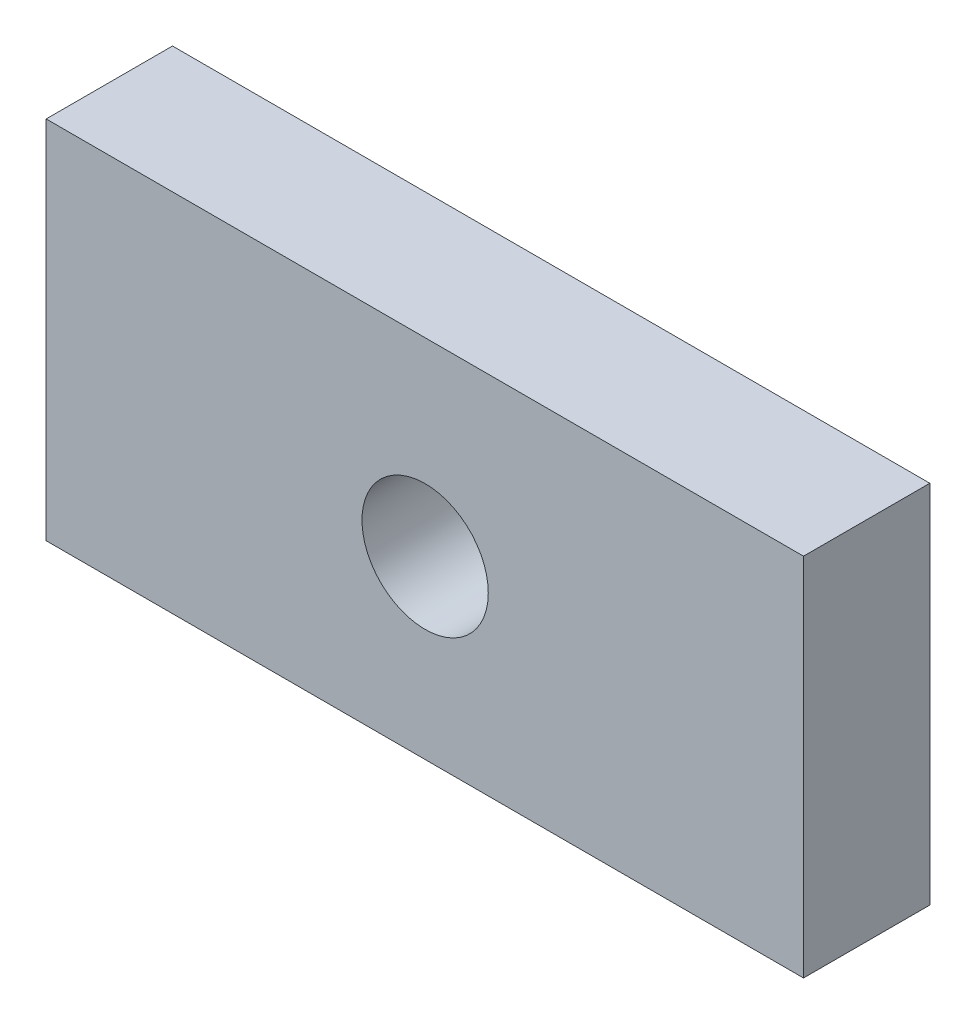
ISO-10303-21;
HEADER;
FILE_DESCRIPTION(('STEP AP214'),'2;1');
FILE_NAME('part.step','',(''),(''),'','','');
FILE_SCHEMA(('AUTOMOTIVE_DESIGN { 1 0 10303 214 1 1 1 1 }'));
ENDSEC;
DATA;
#1=APPLICATION_CONTEXT('core data for automotive mechanical design processes');
#2=APPLICATION_PROTOCOL_DEFINITION('international standard','automotive_design',2000,#1);
#3=PRODUCT_CONTEXT('',#1,'mechanical');
#4=PRODUCT('Part','Part','',(#3));
#5=PRODUCT_RELATED_PRODUCT_CATEGORY('part','',(#4));
#6=PRODUCT_DEFINITION_FORMATION('','',#4);
#7=PRODUCT_DEFINITION_CONTEXT('part definition',#1,'design');
#8=PRODUCT_DEFINITION('design','',#6,#7);
#9=PRODUCT_DEFINITION_SHAPE('','',#8);
#10=(LENGTH_UNIT() NAMED_UNIT(*) SI_UNIT(.MILLI.,.METRE.));
#11=(NAMED_UNIT(*) PLANE_ANGLE_UNIT() SI_UNIT($,.RADIAN.));
#12=(NAMED_UNIT(*) SI_UNIT($,.STERADIAN.) SOLID_ANGLE_UNIT());
#13=UNCERTAINTY_MEASURE_WITH_UNIT(LENGTH_MEASURE(1.E-05),#10,'distance_accuracy_value','');
#14=(GEOMETRIC_REPRESENTATION_CONTEXT(3) GLOBAL_UNCERTAINTY_ASSIGNED_CONTEXT((#13)) GLOBAL_UNIT_ASSIGNED_CONTEXT((#10,
#11,#12)) REPRESENTATION_CONTEXT('',''));
#15=CARTESIAN_POINT('',(0.,0.,0.));
#16=DIRECTION('',(0.,0.,1.));
#17=DIRECTION('',(1.,0.,0.));
#18=AXIS2_PLACEMENT_3D('',#15,#16,#17);
#19=CARTESIAN_POINT('',(0.,0.,12.7));
#20=DIRECTION('',(1.,0.,0.));
#21=DIRECTION('',(0.,0.,-1.));
#22=AXIS2_PLACEMENT_3D('',#19,#20,#21);
#23=PLANE('',#22);
#24=DIRECTION('',(0.,-1.,0.));
#25=VECTOR('',#24,1.);
#26=CARTESIAN_POINT('',(0.,0.,0.));
#27=LINE('',#26,#25);
#28=CARTESIAN_POINT('',(0.,36.7287288622178,0.));
#29=VERTEX_POINT('',#28);
#30=CARTESIAN_POINT('',(0.,0.,0.));
#31=VERTEX_POINT('',#30);
#32=EDGE_CURVE('E107',#29,#31,#27,.T.);
#33=ORIENTED_EDGE('',*,*,#32,.T.);
#34=DIRECTION('',(0.,0.,-1.));
#35=VECTOR('',#34,1.);
#36=CARTESIAN_POINT('',(0.,0.,12.7));
#37=LINE('',#36,#35);
#38=CARTESIAN_POINT('',(0.,0.,12.7));
#39=VERTEX_POINT('',#38);
#40=EDGE_CURVE('E11',#39,#31,#37,.T.);
#41=ORIENTED_EDGE('',*,*,#40,.F.);
#42=DIRECTION('',(0.,-1.,0.));
#43=VECTOR('',#42,1.);
#44=CARTESIAN_POINT('',(0.,0.,12.7));
#45=LINE('',#44,#43);
#46=CARTESIAN_POINT('',(0.,36.7287288622178,12.7));
#47=VERTEX_POINT('',#46);
#48=EDGE_CURVE('E91',#47,#39,#45,.T.);
#49=ORIENTED_EDGE('',*,*,#48,.F.);
#50=DIRECTION('',(0.,0.,-1.));
#51=VECTOR('',#50,1.);
#52=CARTESIAN_POINT('',(0.,36.7287288622178,12.7));
#53=LINE('',#52,#51);
#54=EDGE_CURVE('E103',#47,#29,#53,.T.);
#55=ORIENTED_EDGE('',*,*,#54,.T.);
#56=EDGE_LOOP('',(#33,#41,#49,#55));
#57=FACE_BOUND('',#56,.T.);
#58=ADVANCED_FACE('F39',(#57),#23,.F.);
#59=CARTESIAN_POINT('',(0.,0.,12.7));
#60=DIRECTION('',(0.,1.,0.));
#61=DIRECTION('',(0.,0.,1.));
#62=AXIS2_PLACEMENT_3D('',#59,#60,#61);
#63=PLANE('',#62);
#64=DIRECTION('',(1.,0.,0.));
#65=VECTOR('',#64,1.);
#66=CARTESIAN_POINT('',(0.,0.,0.));
#67=LINE('',#66,#65);
#68=CARTESIAN_POINT('',(76.1425867274176,0.,0.));
#69=VERTEX_POINT('',#68);
#70=EDGE_CURVE('E96',#31,#69,#67,.T.);
#71=ORIENTED_EDGE('',*,*,#70,.T.);
#72=DIRECTION('',(0.,0.,-1.));
#73=VECTOR('',#72,1.);
#74=CARTESIAN_POINT('',(76.1425867274176,0.,12.7));
#75=LINE('',#74,#73);
#76=CARTESIAN_POINT('',(76.1425867274176,0.,12.7));
#77=VERTEX_POINT('',#76);
#78=EDGE_CURVE('E48',#77,#69,#75,.T.);
#79=ORIENTED_EDGE('',*,*,#78,.F.);
#80=DIRECTION('',(1.,0.,0.));
#81=VECTOR('',#80,1.);
#82=CARTESIAN_POINT('',(0.,0.,12.7));
#83=LINE('',#82,#81);
#84=EDGE_CURVE('E86',#39,#77,#83,.T.);
#85=ORIENTED_EDGE('',*,*,#84,.F.);
#86=ORIENTED_EDGE('',*,*,#40,.T.);
#87=EDGE_LOOP('',(#71,#79,#85,#86));
#88=FACE_BOUND('',#87,.T.);
#89=ADVANCED_FACE('F95',(#88),#63,.F.);
#90=CARTESIAN_POINT('',(76.1425867274176,0.,12.7));
#91=DIRECTION('',(-1.,0.,0.));
#92=DIRECTION('',(0.,0.,1.));
#93=AXIS2_PLACEMENT_3D('',#90,#91,#92);
#94=PLANE('',#93);
#95=DIRECTION('',(0.,1.,0.));
#96=VECTOR('',#95,1.);
#97=CARTESIAN_POINT('',(76.1425867274176,0.,0.));
#98=LINE('',#97,#96);
#99=CARTESIAN_POINT('',(76.1425867274176,36.7287288622178,0.));
#100=VERTEX_POINT('',#99);
#101=EDGE_CURVE('E73',#69,#100,#98,.T.);
#102=ORIENTED_EDGE('',*,*,#101,.T.);
#103=DIRECTION('',(0.,0.,-1.));
#104=VECTOR('',#103,1.);
#105=CARTESIAN_POINT('',(76.1425867274176,36.7287288622178,12.7));
#106=LINE('',#105,#104);
#107=CARTESIAN_POINT('',(76.1425867274176,36.7287288622178,12.7));
#108=VERTEX_POINT('',#107);
#109=EDGE_CURVE('E98',#108,#100,#106,.T.);
#110=ORIENTED_EDGE('',*,*,#109,.F.);
#111=DIRECTION('',(0.,1.,0.));
#112=VECTOR('',#111,1.);
#113=CARTESIAN_POINT('',(76.1425867274176,0.,12.7));
#114=LINE('',#113,#112);
#115=EDGE_CURVE('E89',#77,#108,#114,.T.);
#116=ORIENTED_EDGE('',*,*,#115,.F.);
#117=ORIENTED_EDGE('',*,*,#78,.T.);
#118=EDGE_LOOP('',(#102,#110,#116,#117));
#119=FACE_BOUND('',#118,.T.);
#120=ADVANCED_FACE('F99',(#119),#94,.F.);
#121=CARTESIAN_POINT('',(0.,36.7287288622178,12.7));
#122=DIRECTION('',(0.,-1.,0.));
#123=DIRECTION('',(0.,0.,-1.));
#124=AXIS2_PLACEMENT_3D('',#121,#122,#123);
#125=PLANE('',#124);
#126=DIRECTION('',(-1.,0.,0.));
#127=VECTOR('',#126,1.);
#128=CARTESIAN_POINT('',(0.,36.7287288622178,0.));
#129=LINE('',#128,#127);
#130=EDGE_CURVE('E79',#100,#29,#129,.T.);
#131=ORIENTED_EDGE('',*,*,#130,.T.);
#132=ORIENTED_EDGE('',*,*,#54,.F.);
#133=DIRECTION('',(-1.,0.,0.));
#134=VECTOR('',#133,1.);
#135=CARTESIAN_POINT('',(0.,36.7287288622178,12.7));
#136=LINE('',#135,#134);
#137=EDGE_CURVE('E56',#108,#47,#136,.T.);
#138=ORIENTED_EDGE('',*,*,#137,.F.);
#139=ORIENTED_EDGE('',*,*,#109,.T.);
#140=EDGE_LOOP('',(#131,#132,#138,#139));
#141=FACE_BOUND('',#140,.T.);
#142=ADVANCED_FACE('F121',(#141),#125,.F.);
#143=CARTESIAN_POINT('',(0.,0.,12.7));
#144=DIRECTION('',(0.,0.,-1.));
#145=DIRECTION('',(-1.,0.,0.));
#146=AXIS2_PLACEMENT_3D('',#143,#144,#145);
#147=PLANE('',#146);
#148=CARTESIAN_POINT('',(38.1,17.6787288622178,12.7));
#149=DIRECTION('',(0.,0.,1.));
#150=DIRECTION('',(1.,0.,0.));
#151=AXIS2_PLACEMENT_3D('',#148,#149,#150);
#152=CIRCLE('',#151,6.35);
#153=CARTESIAN_POINT('',(44.45,17.6787288622178,12.7));
#154=VERTEX_POINT('',#153);
#155=EDGE_CURVE('E128',#154,#154,#152,.T.);
#156=ORIENTED_EDGE('',*,*,#155,.F.);
#157=EDGE_LOOP('',(#156));
#158=FACE_BOUND('',#157,.T.);
#159=ORIENTED_EDGE('',*,*,#48,.T.);
#160=ORIENTED_EDGE('',*,*,#84,.T.);
#161=ORIENTED_EDGE('',*,*,#115,.T.);
#162=ORIENTED_EDGE('',*,*,#137,.T.);
#163=EDGE_LOOP('',(#159,#160,#161,#162));
#164=FACE_BOUND('',#163,.T.);
#165=ADVANCED_FACE('F87',(#158,#164),#147,.F.);
#166=CARTESIAN_POINT('',(0.,0.,0.));
#167=DIRECTION('',(0.,0.,-1.));
#168=DIRECTION('',(-1.,0.,0.));
#169=AXIS2_PLACEMENT_3D('',#166,#167,#168);
#170=PLANE('',#169);
#171=CARTESIAN_POINT('',(38.1,17.6787288622178,0.));
#172=DIRECTION('',(0.,0.,1.));
#173=DIRECTION('',(1.,0.,0.));
#174=AXIS2_PLACEMENT_3D('',#171,#172,#173);
#175=CIRCLE('',#174,6.35);
#176=CARTESIAN_POINT('',(44.45,17.6787288622178,0.));
#177=VERTEX_POINT('',#176);
#178=EDGE_CURVE('E111',#177,#177,#175,.T.);
#179=ORIENTED_EDGE('',*,*,#178,.T.);
#180=EDGE_LOOP('',(#179));
#181=FACE_BOUND('',#180,.T.);
#182=ORIENTED_EDGE('',*,*,#32,.F.);
#183=ORIENTED_EDGE('',*,*,#130,.F.);
#184=ORIENTED_EDGE('',*,*,#101,.F.);
#185=ORIENTED_EDGE('',*,*,#70,.F.);
#186=EDGE_LOOP('',(#182,#183,#184,#185));
#187=FACE_BOUND('',#186,.T.);
#188=ADVANCED_FACE('F124',(#181,#187),#170,.T.);
#189=CARTESIAN_POINT('',(38.1,17.6787288622178,0.));
#190=DIRECTION('',(0.,0.,1.));
#191=DIRECTION('',(1.,0.,0.));
#192=AXIS2_PLACEMENT_3D('',#189,#190,#191);
#193=CYLINDRICAL_SURFACE('',#192,6.35);
#194=ORIENTED_EDGE('',*,*,#178,.F.);
#195=EDGE_LOOP('',(#194));
#196=FACE_BOUND('',#195,.T.);
#197=ORIENTED_EDGE('',*,*,#155,.T.);
#198=EDGE_LOOP('',(#197));
#199=FACE_BOUND('',#198,.T.);
#200=ADVANCED_FACE('F137',(#196,#199),#193,.F.);
#201=CLOSED_SHELL('',(#58,#89,#120,#142,#165,#188,#200));
#202=MANIFOLD_SOLID_BREP('B2',#201);
#203=ADVANCED_BREP_SHAPE_REPRESENTATION('',(#18,#202),#14);
#204=SHAPE_DEFINITION_REPRESENTATION(#9,#203);
ENDSEC;
END-ISO-10303-21;
